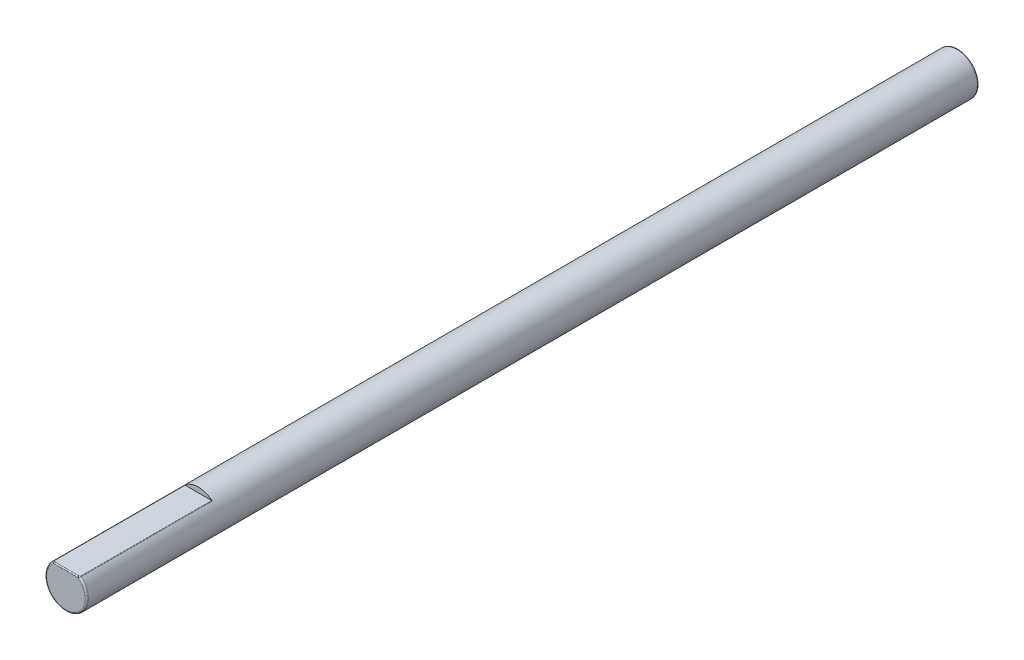
ISO-10303-21;
HEADER;
FILE_DESCRIPTION(('STEP AP214'),'2;1');
FILE_NAME('part.step','',(''),(''),'','','');
FILE_SCHEMA(('AUTOMOTIVE_DESIGN { 1 0 10303 214 1 1 1 1 }'));
ENDSEC;
DATA;
#1=APPLICATION_CONTEXT('core data for automotive mechanical design processes');
#2=APPLICATION_PROTOCOL_DEFINITION('international standard','automotive_design',2000,#1);
#3=PRODUCT_CONTEXT('',#1,'mechanical');
#4=PRODUCT('Part','Part','',(#3));
#5=PRODUCT_RELATED_PRODUCT_CATEGORY('part','',(#4));
#6=PRODUCT_DEFINITION_FORMATION('','',#4);
#7=PRODUCT_DEFINITION_CONTEXT('part definition',#1,'design');
#8=PRODUCT_DEFINITION('design','',#6,#7);
#9=PRODUCT_DEFINITION_SHAPE('','',#8);
#10=(LENGTH_UNIT() NAMED_UNIT(*) SI_UNIT(.MILLI.,.METRE.));
#11=(NAMED_UNIT(*) PLANE_ANGLE_UNIT() SI_UNIT($,.RADIAN.));
#12=(NAMED_UNIT(*) SI_UNIT($,.STERADIAN.) SOLID_ANGLE_UNIT());
#13=UNCERTAINTY_MEASURE_WITH_UNIT(LENGTH_MEASURE(1.E-05),#10,'distance_accuracy_value','');
#14=(GEOMETRIC_REPRESENTATION_CONTEXT(3) GLOBAL_UNCERTAINTY_ASSIGNED_CONTEXT((#13)) GLOBAL_UNIT_ASSIGNED_CONTEXT((#10,
#11,#12)) REPRESENTATION_CONTEXT('',''));
#15=CARTESIAN_POINT('',(0.,0.,0.));
#16=DIRECTION('',(0.,0.,1.));
#17=DIRECTION('',(1.,0.,0.));
#18=AXIS2_PLACEMENT_3D('',#15,#16,#17);
#19=CARTESIAN_POINT('',(0.,0.,67.564));
#20=DIRECTION('',(0.,0.,-1.));
#21=DIRECTION('',(-1.,0.,0.));
#22=AXIS2_PLACEMENT_3D('',#19,#20,#21);
#23=CYLINDRICAL_SURFACE('',#22,1.57734);
#24=CARTESIAN_POINT('',(0.,0.,0.127000000000002));
#25=DIRECTION('',(0.,0.,1.));
#26=DIRECTION('',(1.,0.,0.));
#27=AXIS2_PLACEMENT_3D('',#24,#25,#26);
#28=CIRCLE('',#27,1.57734);
#29=CARTESIAN_POINT('',(1.57734,0.,0.127000000000002));
#30=VERTEX_POINT('',#29);
#31=EDGE_CURVE('E211',#30,#30,#28,.T.);
#32=ORIENTED_EDGE('',*,*,#31,.T.);
#33=EDGE_LOOP('',(#32));
#34=FACE_BOUND('',#33,.T.);
#35=CARTESIAN_POINT('',(0.,0.,67.437));
#36=DIRECTION('',(0.,0.,1.));
#37=DIRECTION('',(1.,0.,0.));
#38=AXIS2_PLACEMENT_3D('',#35,#36,#37);
#39=CIRCLE('',#38,1.57734);
#40=CARTESIAN_POINT('',(1.05008224181955,1.17699989847716,67.437));
#41=VERTEX_POINT('',#40);
#42=CARTESIAN_POINT('',(-1.05008224182005,1.17699989847671,67.437));
#43=VERTEX_POINT('',#42);
#44=EDGE_CURVE('E112',#41,#43,#39,.F.);
#45=ORIENTED_EDGE('',*,*,#44,.T.);
#46=DIRECTION('',(0.,0.,-1.));
#47=VECTOR('',#46,1.);
#48=CARTESIAN_POINT('',(-1.05008224181955,1.17699989847716,67.564));
#49=LINE('',#48,#47);
#50=CARTESIAN_POINT('',(-1.05008224181955,1.17699989847716,57.531));
#51=VERTEX_POINT('',#50);
#52=EDGE_CURVE('E122',#43,#51,#49,.T.);
#53=ORIENTED_EDGE('',*,*,#52,.T.);
#54=CARTESIAN_POINT('',(0.,0.,57.531));
#55=DIRECTION('',(0.,0.,1.));
#56=DIRECTION('',(1.,0.,0.));
#57=AXIS2_PLACEMENT_3D('',#54,#55,#56);
#58=CIRCLE('',#57,1.57734);
#59=CARTESIAN_POINT('',(1.05008224181955,1.17699989847716,57.531));
#60=VERTEX_POINT('',#59);
#61=EDGE_CURVE('E100',#60,#51,#58,.T.);
#62=ORIENTED_EDGE('',*,*,#61,.F.);
#63=DIRECTION('',(0.,0.,-1.));
#64=VECTOR('',#63,1.);
#65=CARTESIAN_POINT('',(1.05008224181955,1.17699989847716,67.564));
#66=LINE('',#65,#64);
#67=EDGE_CURVE('E119',#60,#41,#66,.F.);
#68=ORIENTED_EDGE('',*,*,#67,.T.);
#69=EDGE_LOOP('',(#45,#53,#62,#68));
#70=FACE_BOUND('',#69,.T.);
#71=ADVANCED_FACE('F36',(#34,#70),#23,.T.);
#72=CARTESIAN_POINT('',(0.,0.,67.564));
#73=DIRECTION('',(0.,0.,1.));
#74=DIRECTION('',(1.,0.,0.));
#75=AXIS2_PLACEMENT_3D('',#72,#73,#74);
#76=PLANE('',#75);
#77=CARTESIAN_POINT('',(0.,0.,67.564));
#78=DIRECTION('',(0.,0.,1.));
#79=DIRECTION('',(1.,0.,0.));
#80=AXIS2_PLACEMENT_3D('',#77,#78,#79);
#81=CIRCLE('',#80,1.45034);
#82=CARTESIAN_POINT('',(-0.921288497703081,1.12014,67.564));
#83=VERTEX_POINT('',#82);
#84=CARTESIAN_POINT('',(0.921288497703081,1.12014,67.564));
#85=VERTEX_POINT('',#84);
#86=EDGE_CURVE('E206',#83,#85,#81,.T.);
#87=ORIENTED_EDGE('',*,*,#86,.T.);
#88=DIRECTION('',(1.,0.,0.));
#89=VECTOR('',#88,1.);
#90=CARTESIAN_POINT('',(0.,1.12014,67.564));
#91=LINE('',#90,#89);
#92=EDGE_CURVE('E63',#85,#83,#91,.F.);
#93=ORIENTED_EDGE('',*,*,#92,.T.);
#94=EDGE_LOOP('',(#87,#93));
#95=FACE_BOUND('',#94,.T.);
#96=ADVANCED_FACE('F225',(#95),#76,.T.);
#97=CARTESIAN_POINT('',(0.,0.,67.437));
#98=DIRECTION('',(0.,0.,1.));
#99=DIRECTION('',(1.,0.,0.));
#100=AXIS2_PLACEMENT_3D('',#97,#98,#99);
#101=TOROIDAL_SURFACE('',#100,1.45034,0.127);
#102=ORIENTED_EDGE('',*,*,#86,.F.);
#103=CARTESIAN_POINT('',(-0.87986517052399,1.19634,67.4806697328893));
#104=CARTESIAN_POINT('',(-0.839666437941503,1.19634,67.5901675130064));
#105=CARTESIAN_POINT('',(-0.855817177325138,1.08952494668937,67.5461743322232));
#106=CARTESIAN_POINT('',(-0.886463939819438,1.19634,67.4830622153946));
#107=CARTESIAN_POINT('',(-0.855734599828718,1.19634,67.5869285656864));
#108=CARTESIAN_POINT('',(-0.866077520928326,1.09442117774404,67.5521555380406));
#109=CARTESIAN_POINT('',(-0.893268629419193,1.19634,67.4848406859954));
#110=CARTESIAN_POINT('',(-0.870571194938305,1.19634,67.5830010582053));
#111=CARTESIAN_POINT('',(-0.876745748364134,1.09946153059766,67.5566017147645));
#112=CARTESIAN_POINT('',(-0.907144041533097,1.19634,67.4872156953218));
#113=CARTESIAN_POINT('',(-0.897308581726904,1.19634,67.5742225373876));
#114=CARTESIAN_POINT('',(-0.898673064185134,1.10971823287874,67.5625392385304));
#115=CARTESIAN_POINT('',(-0.914216556838026,1.19634,67.4878018711335));
#116=CARTESIAN_POINT('',(-0.909541477809107,1.19634,67.5693961021727));
#117=CARTESIAN_POINT('',(-0.909936467348809,1.11493572799375,67.5640046782875));
#118=CARTESIAN_POINT('',(-0.928007773539817,1.19634,67.4877982221766));
#119=CARTESIAN_POINT('',(-0.931729882803883,1.19634,67.5592036532382));
#120=CARTESIAN_POINT('',(-0.932074422629895,1.12508474427977,67.5639955550103));
#121=CARTESIAN_POINT('',(-0.934726530800715,1.19634,67.4872655847267));
#122=CARTESIAN_POINT('',(-0.941900280360275,1.19634,67.5539058025541));
#123=CARTESIAN_POINT('',(-0.942940355790191,1.13001755139257,67.5626639603392));
#124=CARTESIAN_POINT('',(-0.947949928776669,1.19634,67.4850469643477));
#125=CARTESIAN_POINT('',(-0.961002053202728,1.19634,67.5423097709004));
#126=CARTESIAN_POINT('',(-0.964475859021033,1.13970137814447,67.5571174094081));
#127=CARTESIAN_POINT('',(-0.954455307669196,1.19634,67.4833655256658));
#128=CARTESIAN_POINT('',(-0.970051164578806,1.19634,67.5360350474439));
#129=CARTESIAN_POINT('',(-0.975146033298497,1.14445303643834,67.5529138137577));
#130=CARTESIAN_POINT('',(-0.967680619915438,1.19634,67.4784054251793));
#131=CARTESIAN_POINT('',(-0.987839601379769,1.19634,67.5213178577252));
#132=CARTESIAN_POINT('',(-0.996976756655438,1.15408756250358,67.5405135633987));
#133=CARTESIAN_POINT('',(-0.974348807950885,1.19634,67.4749748777313));
#134=CARTESIAN_POINT('',(-0.996616052063423,1.19634,67.5127005981731));
#135=CARTESIAN_POINT('',(-1.00806727410583,1.15892990057361,67.5319371944349));
#136=CARTESIAN_POINT('',(-0.984862187982598,1.19634,67.4670807053982));
#137=CARTESIAN_POINT('',(-1.0101662139932,1.19634,67.4951149420122));
#138=CARTESIAN_POINT('',(-1.02564926830044,1.16654490914749,67.5122017634136));
#139=CARTESIAN_POINT('',(-0.989003658290052,1.19634,67.463038906611));
#140=CARTESIAN_POINT('',(-1.01543871618516,1.19634,67.4867363605221));
#141=CARTESIAN_POINT('',(-1.03261129671026,1.16953727267212,67.5020972665035));
#142=CARTESIAN_POINT('',(-0.994760773433793,1.19634,67.4547827897831));
#143=CARTESIAN_POINT('',(-1.02267410023603,1.19634,67.4704489448948));
#144=CARTESIAN_POINT('',(-1.04231409975494,1.17369163865705,67.4814569744761));
#145=CARTESIAN_POINT('',(-0.996743375883656,1.19634,67.4508399999536));
#146=CARTESIAN_POINT('',(-1.0251585729744,1.19634,67.462900537877));
#147=CARTESIAN_POINT('',(-1.04566583106471,1.17512006094954,67.4715999999009));
#148=CARTESIAN_POINT('',(-0.998872574060043,1.19634,67.4435291900877));
#149=CARTESIAN_POINT('',(-1.02780589371633,1.19634,67.4491535667342));
#150=CARTESIAN_POINT('',(-1.04926743163161,1.17665365075781,67.4533229752066));
#151=CARTESIAN_POINT('',(-0.999352999215082,1.19634,67.440261835307));
#152=CARTESIAN_POINT('',(-1.02840375915452,1.19634,67.4430637494845));
#153=CARTESIAN_POINT('',(-1.05008115678193,1.17699944738944,67.4451545882335));
#154=CARTESIAN_POINT('',(-0.999354053428679,1.19634,67.4348200261891));
#155=CARTESIAN_POINT('',(-1.02840517657672,1.19634,67.4329474411081));
#156=CARTESIAN_POINT('',(-1.05008296698962,1.17700019994274,67.4315500654955));
#157=CARTESIAN_POINT('',(-0.999140170580108,1.19634,67.4326425177128));
#158=CARTESIAN_POINT('',(-1.02813927476163,1.19634,67.4288948027106));
#159=CARTESIAN_POINT('',(-1.04972071712509,1.17684624886117,67.4261062943523));
#160=CARTESIAN_POINT('',(-0.998311894428676,1.19634,67.4283547269963));
#161=CARTESIAN_POINT('',(-1.02711193958815,1.19634,67.4208858538938));
#162=CARTESIAN_POINT('',(-1.04831906664627,1.17624980209277,67.4153868175988));
#163=CARTESIAN_POINT('',(-0.997695770873582,1.19634,67.4262447766828));
#164=CARTESIAN_POINT('',(-1.02634611648331,1.19634,67.4169215230605));
#165=CARTESIAN_POINT('',(-1.04727674067305,1.17580605985672,67.410111941805));
#166=CARTESIAN_POINT('',(-0.996893696151886,1.19634,67.4242096492899));
#167=CARTESIAN_POINT('',(-1.02534907888547,1.19634,67.4130743224521));
#168=CARTESIAN_POINT('',(-1.04592067981759,1.17522820619018,67.4050241232296));
#169=(BOUNDED_SURFACE() B_SPLINE_SURFACE(3,2,((#103,#104,#105),(#106,#107,#108),(#109,#110,
#111),(#112,#113,#114),(#115,#116,#117),(#118,#119,#120),(#121,#122,#123),(#124,#125,#126),
(#127,#128,#129),(#130,#131,#132),(#133,#134,#135),(#136,#137,#138),(#139,#140,#141),(#142,#143,
#144),(#145,#146,#147),(#148,#149,#150),(#151,#152,#153),(#154,#155,#156),(#157,#158,#159),
(#160,#161,#162),(#163,#164,#165),(#166,#167,#168)),.UNSPECIFIED.,.F.,.F.,
.F.) B_SPLINE_SURFACE_WITH_KNOTS((4,2,2,2,2,2,2,2,2,2,4),(3,3),(0.,0.0210049041153107,
0.0421916068899117,0.0623217667328647,0.0823727563898449,0.104572987576242,0.121643881976073,
0.134639503134324,0.144405530325835,0.150932433605052,0.157487599227386),(0.,1.),
.UNSPECIFIED.) GEOMETRIC_REPRESENTATION_ITEM() RATIONAL_B_SPLINE_SURFACE(((1.,0.546912994379381,
1.),(1.,0.576246040533938,1.),(1.,0.604159736509278,1.),(1.,0.657529870647927,1.),(1.,
0.682962950087153,1.),(1.,0.730046602659604,1.),(1.,0.751822554653164,1.),(1.,0.792954989594646,
1.),(1.,0.812320651279741,1.),(1.,0.85038125516778,1.),(1.,0.868781803166435,1.),(1.,
0.897019931958255,1.),(1.,0.907853689511749,1.),(1.,0.922730545184066,1.),(1.,0.927777333961913,
1.),(1.,0.933182770330257,1.),(1.,0.934394800989486,1.),(1.,0.934397302941354,1.),(1.,
0.933857607662283,1.),(1.,0.931759073909199,1.),(1.,0.930195832531433,1.),(1.,0.92815471192234,1.))) REPRESENTATION_ITEM('') SURFACE());
#170=CARTESIAN_POINT('',(-0.855817177325138,1.08952494668937,67.5461743322232));
#171=CARTESIAN_POINT('',(-0.866077520928326,1.09442117774404,67.5521555380406));
#172=CARTESIAN_POINT('',(-0.876745748364134,1.09946153059766,67.5566017147645));
#173=CARTESIAN_POINT('',(-0.898673064185134,1.10971823287874,67.5625392385304));
#174=CARTESIAN_POINT('',(-0.909936467348809,1.11493572799375,67.5640046782875));
#175=CARTESIAN_POINT('',(-0.932074422629895,1.12508474427977,67.5639955550103));
#176=CARTESIAN_POINT('',(-0.942940355790191,1.13001755139257,67.5626639603392));
#177=CARTESIAN_POINT('',(-0.964475859021033,1.13970137814447,67.5571174094081));
#178=CARTESIAN_POINT('',(-0.975146033298497,1.14445303643834,67.5529138137577));
#179=CARTESIAN_POINT('',(-0.996976756655437,1.15408756250358,67.5405135633987));
#180=CARTESIAN_POINT('',(-1.00806727410583,1.15892990057361,67.5319371944349));
#181=CARTESIAN_POINT('',(-1.02564926830044,1.16654490914749,67.5122017634136));
#182=CARTESIAN_POINT('',(-1.03261129671026,1.16953727267212,67.5020972665035));
#183=CARTESIAN_POINT('',(-1.04231409975494,1.17369163865705,67.4814569744761));
#184=CARTESIAN_POINT('',(-1.04566583106471,1.17512006094954,67.4715999999009));
#185=CARTESIAN_POINT('',(-1.04926743163161,1.17665365075781,67.4533229752066));
#186=CARTESIAN_POINT('',(-1.05008115678193,1.17699944738944,67.4451545882335));
#187=CARTESIAN_POINT('',(-1.05008296698962,1.17700019994274,67.4315500654955));
#188=CARTESIAN_POINT('',(-1.04972071712509,1.17684624886117,67.4261062943523));
#189=CARTESIAN_POINT('',(-1.04831906664627,1.17624980209277,67.4153868175988));
#190=CARTESIAN_POINT('',(-1.04727674067305,1.17580605985672,67.410111941805));
#191=CARTESIAN_POINT('',(-1.04592067981759,1.17522820619018,67.4050241232296));
#192=B_SPLINE_CURVE_WITH_KNOTS('',3,(#170,#171,#172,#173,#174,#175,#176,#177,#178,#179,#180,
#181,#182,#183,#184,#185,#186,#187,#188,#189,#190,#191),.UNSPECIFIED.,.F.,.F.,(4,2,2,2,2,2,2,2,
2,2,4),(0.,0.0210049041153107,0.0421916068899117,0.0623217667328647,0.0823727563898449,
0.104572987576242,0.121643881976073,0.134639503134324,0.144405530325835,0.150932433605052,
0.157487599227386),.UNSPECIFIED.);
#193=EDGE_CURVE('E139',#83,#43,#192,.T.);
#194=ORIENTED_EDGE('',*,*,#193,.T.);
#195=ORIENTED_EDGE('',*,*,#44,.F.);
#196=CARTESIAN_POINT('',(0.996893696150638,1.19634,67.4242096492867));
#197=CARTESIAN_POINT('',(1.02534907888392,1.19634,67.413074322446));
#198=CARTESIAN_POINT('',(1.04592067981548,1.17522820618928,67.4050241232216));
#199=CARTESIAN_POINT('',(0.997693459868979,1.19634,67.4262456754124));
#200=CARTESIAN_POINT('',(1.02634298468636,1.19634,67.4169230148123));
#201=CARTESIAN_POINT('',(1.04727277381541,1.1758044069408,67.4101141887601));
#202=CARTESIAN_POINT('',(0.998310562328588,1.19634,67.4283544865847));
#203=CARTESIAN_POINT('',(1.02711015906912,1.19634,67.420885317168));
#204=CARTESIAN_POINT('',(1.04831678396097,1.17624884796893,67.4153862167199));
#205=CARTESIAN_POINT('',(0.999141140633466,1.19634,67.4326409122798));
#206=CARTESIAN_POINT('',(1.02814059866535,1.19634,67.4288918708969));
#207=CARTESIAN_POINT('',(1.04972238564775,1.17684694084344,67.4261022808734));
#208=CARTESIAN_POINT('',(0.999356174847839,1.19634,67.4348182277596));
#209=CARTESIAN_POINT('',(1.02840804677395,1.19634,67.4329441887454));
#210=CARTESIAN_POINT('',(1.05008661194096,1.17700171540507,67.4315455694602));
#211=CARTESIAN_POINT('',(0.999348556027344,1.19634,67.4413528985692));
#212=CARTESIAN_POINT('',(1.02839774935248,1.19634,67.4450919872012));
#213=CARTESIAN_POINT('',(1.05007352290063,1.176996273487,67.4478822463012));
#214=CARTESIAN_POINT('',(0.998477410604523,1.19634,67.4457235372999));
#215=CARTESIAN_POINT('',(1.0273106459164,1.19634,67.4532547962304));
#216=CARTESIAN_POINT('',(1.04859760378083,1.17636933514978,67.4588088432124));
#217=CARTESIAN_POINT('',(0.995318495118498,1.19634,67.4538353025482));
#218=CARTESIAN_POINT('',(1.02338106547821,1.19634,67.4686217679901));
#219=CARTESIAN_POINT('',(1.0432581459333,1.17409321148618,67.4790882563981));
#220=CARTESIAN_POINT('',(0.993038365441964,1.19634,67.4575796867753));
#221=CARTESIAN_POINT('',(1.02051709178677,1.19634,67.4758841919937));
#222=CARTESIAN_POINT('',(1.03940748475289,1.17244953947149,67.488449216947));
#223=CARTESIAN_POINT('',(0.986355866778853,1.19634,67.4658590327874));
#224=CARTESIAN_POINT('',(1.01207728618304,1.19634,67.4925269221543));
#225=CARTESIAN_POINT('',(1.02815903916294,1.16762443418578,67.5091475819556));
#226=CARTESIAN_POINT('',(0.98145990113402,1.19634,67.4699773023808));
#227=CARTESIAN_POINT('',(1.00580558693023,1.19634,67.5013341876952));
#228=CARTESIAN_POINT('',(1.01994447754918,1.16408358146227,67.5194432559472));
#229=CARTESIAN_POINT('',(0.968263559261528,1.19634,67.4784400012589));
#230=CARTESIAN_POINT('',(0.988576459614419,1.19634,67.5212265811864));
#231=CARTESIAN_POINT('',(0.997936247605258,1.1545131048354,67.540600003153));
#232=CARTESIAN_POINT('',(0.959459960177419,1.19634,67.4819359476676));
#233=CARTESIAN_POINT('',(0.976760217081495,1.19634,67.5311220862782));
#234=CARTESIAN_POINT('',(0.983362339188115,1.14810669595002,67.5493398691721));
#235=CARTESIAN_POINT('',(0.940881620447271,1.19634,67.4866750597365));
#236=CARTESIAN_POINT('',(0.950794587306845,1.19634,67.5491661845361));
#237=CARTESIAN_POINT('',(0.952912059810947,1.13453402071416,67.5611876493381));
#238=CARTESIAN_POINT('',(0.931080413766853,1.19634,67.4877990196295));
#239=CARTESIAN_POINT('',(0.936290387324466,1.19634,67.5571125030473));
#240=CARTESIAN_POINT('',(0.937006881160724,1.12734588165478,67.5639975490669));
#241=CARTESIAN_POINT('',(0.914246763593576,1.19634,67.4878007050252));
#242=CARTESIAN_POINT('',(0.909592336731492,1.19634,67.5693698084138));
#243=CARTESIAN_POINT('',(0.909984818605025,1.11495798022909,67.5640017625579));
#244=CARTESIAN_POINT('',(0.907209834207561,1.19634,67.4872206513581));
#245=CARTESIAN_POINT('',(0.897425871058924,1.19634,67.5741746383883));
#246=CARTESIAN_POINT('',(0.898777742275719,1.10976678471946,67.5625516283933));
#247=CARTESIAN_POINT('',(0.893336091037547,1.19634,67.4848582635467));
#248=CARTESIAN_POINT('',(0.870711766506312,1.19634,67.5829639384218));
#249=CARTESIAN_POINT('',(0.876851633922378,1.09951148207295,67.5566456588688));
#250=CARTESIAN_POINT('',(0.886499472055093,1.19634,67.4830747970968));
#251=CARTESIAN_POINT('',(0.855817751976035,1.19634,67.586912186489));
#252=CARTESIAN_POINT('',(0.86613307169616,1.0944474992908,67.5521869927452));
#253=CARTESIAN_POINT('',(0.879865170524432,1.19634,67.4806697328894));
#254=CARTESIAN_POINT('',(0.839666437942626,1.19634,67.5901675130062));
#255=CARTESIAN_POINT('',(0.855817177325819,1.08952494668969,67.5461743322236));
#256=(BOUNDED_SURFACE() B_SPLINE_SURFACE(3,2,((#196,#197,#198),(#199,#200,#201),(#202,#203,
#204),(#205,#206,#207),(#208,#209,#210),(#211,#212,#213),(#214,#215,#216),(#217,#218,#219),
(#220,#221,#222),(#223,#224,#225),(#226,#227,#228),(#229,#230,#231),(#232,#233,#234),(#235,#236,
#237),(#238,#239,#240),(#241,#242,#243),(#244,#245,#246),(#247,#248,#249),(#250,#251,#252),
(#253,#254,#255)),.UNSPECIFIED.,.F.,.F.,.F.) B_SPLINE_SURFACE_WITH_KNOTS((4,2,2,2,2,2,2,2,2,4),
(3,3),(0.,0.00655376163974078,0.0130820685907793,0.0261068277571614,0.0390615709761231,
0.0579167770109421,0.0858638126093137,0.115184836333704,0.136270684248077,0.157376399807142),
(0.,1.),.UNSPECIFIED.) GEOMETRIC_REPRESENTATION_ITEM() RATIONAL_B_SPLINE_SURFACE(((1.,
0.928154711919159,1.),(1.,0.930190380602178,1.),(1.,0.931755899269483,1.),(1.,0.93385986323189,
1.),(1.,0.934402274044589,1.),(1.,0.934384383059323,1.),(1.,0.932189618950601,1.),(1.,
0.924141494950078,1.),(1.,0.918307865642746,1.),(1.,0.900934238544066,1.),(1.,0.888005365570514,
1.),(1.,0.852059774208675,1.),(1.,0.827184858411696,1.),(1.,0.771538943160833,1.),(1.,
0.740538193773175,1.),(1.,0.683064998474458,1.),(1.,0.657766177008975,1.),(1.,0.604435505018622,
1.),(1.,0.576401101821406,1.),(1.,0.546912994381296,1.))) REPRESENTATION_ITEM('') SURFACE());
#257=CARTESIAN_POINT('',(1.04592067981548,1.17522820618928,67.4050241232216));
#258=CARTESIAN_POINT('',(1.04727277381541,1.1758044069408,67.4101141887601));
#259=CARTESIAN_POINT('',(1.04831678396097,1.17624884796893,67.4153862167199));
#260=CARTESIAN_POINT('',(1.04972238564775,1.17684694084344,67.4261022808734));
#261=CARTESIAN_POINT('',(1.05008661194096,1.17700171540507,67.4315455694602));
#262=CARTESIAN_POINT('',(1.05007352290063,1.176996273487,67.4478822463012));
#263=CARTESIAN_POINT('',(1.04859760378083,1.17636933514978,67.4588088432124));
#264=CARTESIAN_POINT('',(1.0432581459333,1.17409321148618,67.4790882563981));
#265=CARTESIAN_POINT('',(1.03940748475289,1.17244953947149,67.488449216947));
#266=CARTESIAN_POINT('',(1.02815903916294,1.16762443418578,67.5091475819556));
#267=CARTESIAN_POINT('',(1.01994447754918,1.16408358146227,67.5194432559472));
#268=CARTESIAN_POINT('',(0.997936247605258,1.1545131048354,67.540600003153));
#269=CARTESIAN_POINT('',(0.983362339188116,1.14810669595002,67.5493398691721));
#270=CARTESIAN_POINT('',(0.952912059810947,1.13453402071416,67.5611876493381));
#271=CARTESIAN_POINT('',(0.937006881160724,1.12734588165478,67.5639975490669));
#272=CARTESIAN_POINT('',(0.909984818605026,1.11495798022909,67.5640017625579));
#273=CARTESIAN_POINT('',(0.898777742275719,1.10976678471946,67.5625516283933));
#274=CARTESIAN_POINT('',(0.876851633922378,1.09951148207295,67.5566456588688));
#275=CARTESIAN_POINT('',(0.86613307169616,1.0944474992908,67.5521869927452));
#276=CARTESIAN_POINT('',(0.855817177325819,1.08952494668969,67.5461743322236));
#277=B_SPLINE_CURVE_WITH_KNOTS('',3,(#257,#258,#259,#260,#261,#262,#263,#264,#265,#266,#267,
#268,#269,#270,#271,#272,#273,#274,#275,#276),.UNSPECIFIED.,.F.,.F.,(4,2,2,2,2,2,2,2,2,4),(0.,
0.00655376163974078,0.0130820685907793,0.0261068277571614,0.0390615709761231,0.0579167770109421,
0.0858638126093137,0.115184836333704,0.136270684248077,0.157376399807142),.UNSPECIFIED.);
#278=EDGE_CURVE('E57',#41,#85,#277,.T.);
#279=ORIENTED_EDGE('',*,*,#278,.T.);
#280=EDGE_LOOP('',(#102,#194,#195,#279));
#281=FACE_BOUND('',#280,.T.);
#282=ADVANCED_FACE('F145',(#281),#101,.T.);
#283=CARTESIAN_POINT('',(0.,0.,0.));
#284=DIRECTION('',(0.,0.,1.));
#285=DIRECTION('',(1.,0.,0.));
#286=AXIS2_PLACEMENT_3D('',#283,#284,#285);
#287=PLANE('',#286);
#288=CARTESIAN_POINT('',(0.,0.,0.));
#289=DIRECTION('',(0.,0.,1.));
#290=DIRECTION('',(1.,0.,0.));
#291=AXIS2_PLACEMENT_3D('',#288,#289,#290);
#292=CIRCLE('',#291,1.45034);
#293=CARTESIAN_POINT('',(1.45034,0.,0.));
#294=VERTEX_POINT('',#293);
#295=EDGE_CURVE('E208',#294,#294,#292,.F.);
#296=ORIENTED_EDGE('',*,*,#295,.T.);
#297=EDGE_LOOP('',(#296));
#298=FACE_BOUND('',#297,.T.);
#299=ADVANCED_FACE('F232',(#298),#287,.F.);
#300=CARTESIAN_POINT('',(0.,0.,0.127000000000002));
#301=DIRECTION('',(0.,0.,1.));
#302=DIRECTION('',(1.,0.,0.));
#303=AXIS2_PLACEMENT_3D('',#300,#301,#302);
#304=TOROIDAL_SURFACE('',#303,1.45034,0.127);
#305=ORIENTED_EDGE('',*,*,#295,.F.);
#306=EDGE_LOOP('',(#305));
#307=FACE_BOUND('',#306,.T.);
#308=ORIENTED_EDGE('',*,*,#31,.F.);
#309=EDGE_LOOP('',(#308));
#310=FACE_BOUND('',#309,.T.);
#311=ADVANCED_FACE('F233',(#307,#310),#304,.T.);
#312=CARTESIAN_POINT('',(-1.57734,1.57733999999999,57.531));
#313=DIRECTION('',(0.,0.,1.));
#314=DIRECTION('',(1.,0.,0.));
#315=AXIS2_PLACEMENT_3D('',#312,#313,#314);
#316=PLANE('',#315);
#317=ORIENTED_EDGE('',*,*,#61,.T.);
#318=CARTESIAN_POINT('',(-0.999353631103625,1.12014,57.531));
#319=DIRECTION('',(0.,0.,1.));
#320=DIRECTION('',(1.,0.,0.));
#321=AXIS2_PLACEMENT_3D('',#318,#319,#320);
#322=CIRCLE('',#321,0.0762);
#323=CARTESIAN_POINT('',(-0.999353631103625,1.19633999999999,57.531));
#324=VERTEX_POINT('',#323);
#325=EDGE_CURVE('E49',#51,#324,#322,.F.);
#326=ORIENTED_EDGE('',*,*,#325,.T.);
#327=DIRECTION('',(1.,0.,0.));
#328=VECTOR('',#327,1.);
#329=CARTESIAN_POINT('',(-1.57734,1.19633999999999,57.531));
#330=LINE('',#329,#328);
#331=CARTESIAN_POINT('',(0.999353631103625,1.19633999999999,57.531));
#332=VERTEX_POINT('',#331);
#333=EDGE_CURVE('E98',#324,#332,#330,.T.);
#334=ORIENTED_EDGE('',*,*,#333,.T.);
#335=CARTESIAN_POINT('',(0.999353631103625,1.12014,57.531));
#336=DIRECTION('',(0.,0.,1.));
#337=DIRECTION('',(1.,0.,0.));
#338=AXIS2_PLACEMENT_3D('',#335,#336,#337);
#339=CIRCLE('',#338,0.0762);
#340=EDGE_CURVE('E11',#332,#60,#339,.F.);
#341=ORIENTED_EDGE('',*,*,#340,.T.);
#342=EDGE_LOOP('',(#317,#326,#334,#341));
#343=FACE_BOUND('',#342,.T.);
#344=ADVANCED_FACE('F97',(#343),#316,.T.);
#345=CARTESIAN_POINT('',(-1.57734,1.19633999999999,57.531));
#346=DIRECTION('',(0.,1.,0.));
#347=DIRECTION('',(0.,0.,1.));
#348=AXIS2_PLACEMENT_3D('',#345,#346,#347);
#349=PLANE('',#348);
#350=ORIENTED_EDGE('',*,*,#333,.F.);
#351=DIRECTION('',(0.,0.,1.));
#352=VECTOR('',#351,1.);
#353=CARTESIAN_POINT('',(-0.999353631103625,1.19634,67.4369999999996));
#354=LINE('',#353,#352);
#355=CARTESIAN_POINT('',(-0.999353631103625,1.19634,67.437));
#356=VERTEX_POINT('',#355);
#357=EDGE_CURVE('E109',#324,#356,#354,.T.);
#358=ORIENTED_EDGE('',*,*,#357,.T.);
#359=CARTESIAN_POINT('',(-0.996893696151886,1.19634,67.4242096492899));
#360=CARTESIAN_POINT('',(-0.997695770873582,1.19634,67.4262447766828));
#361=CARTESIAN_POINT('',(-0.998311894428677,1.19634,67.4283547269963));
#362=CARTESIAN_POINT('',(-0.999140170580109,1.19634,67.4326425177128));
#363=CARTESIAN_POINT('',(-0.999354053428679,1.19634,67.4348200261891));
#364=CARTESIAN_POINT('',(-0.999352999215082,1.19634,67.440261835307));
#365=CARTESIAN_POINT('',(-0.998872574060043,1.19634,67.4435291900877));
#366=CARTESIAN_POINT('',(-0.996743375883656,1.19634,67.4508399999536));
#367=CARTESIAN_POINT('',(-0.994760773433793,1.19634,67.4547827897831));
#368=CARTESIAN_POINT('',(-0.989003658290052,1.19634,67.463038906611));
#369=CARTESIAN_POINT('',(-0.984862187982598,1.19634,67.4670807053982));
#370=CARTESIAN_POINT('',(-0.974348807950885,1.19634,67.4749748777313));
#371=CARTESIAN_POINT('',(-0.967680619915438,1.19634,67.4784054251793));
#372=CARTESIAN_POINT('',(-0.954455307669196,1.19634,67.4833655256658));
#373=CARTESIAN_POINT('',(-0.947949928776669,1.19634,67.4850469643477));
#374=CARTESIAN_POINT('',(-0.934726530800715,1.19634,67.4872655847267));
#375=CARTESIAN_POINT('',(-0.928007773539817,1.19634,67.4877982221766));
#376=CARTESIAN_POINT('',(-0.914216556838026,1.19634,67.4878018711335));
#377=CARTESIAN_POINT('',(-0.907144041533097,1.19634,67.4872156953218));
#378=CARTESIAN_POINT('',(-0.893268629419193,1.19634,67.4848406859954));
#379=CARTESIAN_POINT('',(-0.886463939819438,1.19634,67.4830622153946));
#380=CARTESIAN_POINT('',(-0.87986517052399,1.19634,67.4806697328893));
#381=B_SPLINE_CURVE_WITH_KNOTS('',3,(#359,#360,#361,#362,#363,#364,#365,#366,#367,#368,#369,
#370,#371,#372,#373,#374,#375,#376,#377,#378,#379,#380),.UNSPECIFIED.,.F.,.F.,(4,2,2,2,2,2,2,2,
2,2,4),(0.,0.00655516562233412,0.0130820689015507,0.0228480960930624,0.0358437172513129,
0.0529146116511436,0.075114842837541,0.0951658324945212,0.115295992337474,0.136482695112075,
0.157487599227386),.UNSPECIFIED.);
#382=CARTESIAN_POINT('',(-0.921288497703081,1.19634,67.4878));
#383=VERTEX_POINT('',#382);
#384=EDGE_CURVE('E120',#356,#383,#381,.T.);
#385=ORIENTED_EDGE('',*,*,#384,.T.);
#386=DIRECTION('',(1.,0.,0.));
#387=VECTOR('',#386,1.);
#388=CARTESIAN_POINT('',(-1.57734,1.19634,67.4878));
#389=LINE('',#388,#387);
#390=CARTESIAN_POINT('',(0.921288497703052,1.19634,67.4878));
#391=VERTEX_POINT('',#390);
#392=EDGE_CURVE('E198',#383,#391,#389,.T.);
#393=ORIENTED_EDGE('',*,*,#392,.T.);
#394=CARTESIAN_POINT('',(0.879865170524432,1.19634,67.4806697328894));
#395=CARTESIAN_POINT('',(0.886499472055093,1.19634,67.4830747970968));
#396=CARTESIAN_POINT('',(0.893336091037547,1.19634,67.4848582635467));
#397=CARTESIAN_POINT('',(0.907209834207561,1.19634,67.4872206513581));
#398=CARTESIAN_POINT('',(0.914246763593576,1.19634,67.4878007050252));
#399=CARTESIAN_POINT('',(0.931080413766853,1.19634,67.4877990196295));
#400=CARTESIAN_POINT('',(0.940881620447271,1.19634,67.4866750597365));
#401=CARTESIAN_POINT('',(0.959459960177418,1.19634,67.4819359476676));
#402=CARTESIAN_POINT('',(0.968263559261528,1.19634,67.4784400012589));
#403=CARTESIAN_POINT('',(0.98145990113402,1.19634,67.4699773023808));
#404=CARTESIAN_POINT('',(0.986355866778853,1.19634,67.4658590327874));
#405=CARTESIAN_POINT('',(0.993038365441963,1.19634,67.4575796867753));
#406=CARTESIAN_POINT('',(0.995318495118498,1.19634,67.4538353025482));
#407=CARTESIAN_POINT('',(0.998477410604523,1.19634,67.4457235372999));
#408=CARTESIAN_POINT('',(0.999348556027344,1.19634,67.4413528985692));
#409=CARTESIAN_POINT('',(0.999356174847839,1.19634,67.4348182277596));
#410=CARTESIAN_POINT('',(0.999141140633466,1.19634,67.4326409122798));
#411=CARTESIAN_POINT('',(0.998310562328588,1.19634,67.4283544865847));
#412=CARTESIAN_POINT('',(0.997693459868979,1.19634,67.4262456754124));
#413=CARTESIAN_POINT('',(0.996893696150638,1.19634,67.4242096492867));
#414=B_SPLINE_CURVE_WITH_KNOTS('',3,(#394,#395,#396,#397,#398,#399,#400,#401,#402,#403,#404,
#405,#406,#407,#408,#409,#410,#411,#412,#413),.UNSPECIFIED.,.F.,.F.,(4,2,2,2,2,2,2,2,2,4),(0.,
0.0211057155590645,0.0421915634734381,0.0715125871978283,0.0994596227961999,0.118314828831019,
0.131269572049981,0.144294331216363,0.150822638167401,0.157376399807142),.UNSPECIFIED.);
#415=CARTESIAN_POINT('',(0.999353631103625,1.19634,67.437));
#416=VERTEX_POINT('',#415);
#417=EDGE_CURVE('E195',#391,#416,#414,.T.);
#418=ORIENTED_EDGE('',*,*,#417,.T.);
#419=DIRECTION('',(0.,0.,1.));
#420=VECTOR('',#419,1.);
#421=CARTESIAN_POINT('',(0.999353631103625,1.19633999999999,57.531));
#422=LINE('',#421,#420);
#423=EDGE_CURVE('E111',#416,#332,#422,.F.);
#424=ORIENTED_EDGE('',*,*,#423,.T.);
#425=EDGE_LOOP('',(#350,#358,#385,#393,#418,#424));
#426=FACE_BOUND('',#425,.T.);
#427=ADVANCED_FACE('F108',(#426),#349,.T.);
#428=CARTESIAN_POINT('',(0.999353631103625,1.12014,67.564));
#429=DIRECTION('',(0.,0.,-1.));
#430=DIRECTION('',(-1.,0.,0.));
#431=AXIS2_PLACEMENT_3D('',#428,#429,#430);
#432=CYLINDRICAL_SURFACE('',#431,0.0762);
#433=ORIENTED_EDGE('',*,*,#340,.F.);
#434=ORIENTED_EDGE('',*,*,#423,.F.);
#435=CARTESIAN_POINT('',(0.999353631103625,1.12014,67.437));
#436=DIRECTION('',(0.,0.,1.));
#437=DIRECTION('',(1.,0.,0.));
#438=AXIS2_PLACEMENT_3D('',#435,#436,#437);
#439=CIRCLE('',#438,0.0762);
#440=EDGE_CURVE('E113',#41,#416,#439,.T.);
#441=ORIENTED_EDGE('',*,*,#440,.F.);
#442=ORIENTED_EDGE('',*,*,#67,.F.);
#443=EDGE_LOOP('',(#433,#434,#441,#442));
#444=FACE_BOUND('',#443,.T.);
#445=ADVANCED_FACE('F38',(#444),#432,.T.);
#446=ORIENTED_EDGE('',*,*,#440,.T.);
#447=ORIENTED_EDGE('',*,*,#417,.F.);
#448=CARTESIAN_POINT('',(0.921288497703052,1.12014,67.4878));
#449=DIRECTION('',(-1.,0.,-2.36191024452227E-13));
#450=DIRECTION('',(-2.36191024452227E-13,0.,1.));
#451=AXIS2_PLACEMENT_3D('',#448,#449,#450);
#452=CIRCLE('',#451,0.0762);
#453=EDGE_CURVE('E188',#85,#391,#452,.T.);
#454=ORIENTED_EDGE('',*,*,#453,.F.);
#455=ORIENTED_EDGE('',*,*,#278,.F.);
#456=EDGE_LOOP('',(#446,#447,#454,#455));
#457=FACE_BOUND('',#456,.T.);
#458=ADVANCED_FACE('F155',(#457),#256,.T.);
#459=CARTESIAN_POINT('',(-1.57734,1.12014,67.4878));
#460=DIRECTION('',(1.,0.,0.));
#461=DIRECTION('',(0.,0.,-1.));
#462=AXIS2_PLACEMENT_3D('',#459,#460,#461);
#463=CYLINDRICAL_SURFACE('',#462,0.0762);
#464=ORIENTED_EDGE('',*,*,#453,.T.);
#465=ORIENTED_EDGE('',*,*,#392,.F.);
#466=CARTESIAN_POINT('',(-0.921288497703081,1.12014,67.4878));
#467=DIRECTION('',(-1.,0.,0.));
#468=DIRECTION('',(0.,0.,1.));
#469=AXIS2_PLACEMENT_3D('',#466,#467,#468);
#470=CIRCLE('',#469,0.0762);
#471=EDGE_CURVE('E186',#83,#383,#470,.T.);
#472=ORIENTED_EDGE('',*,*,#471,.F.);
#473=ORIENTED_EDGE('',*,*,#92,.F.);
#474=EDGE_LOOP('',(#464,#465,#472,#473));
#475=FACE_BOUND('',#474,.T.);
#476=ADVANCED_FACE('F159',(#475),#463,.T.);
#477=ORIENTED_EDGE('',*,*,#471,.T.);
#478=ORIENTED_EDGE('',*,*,#384,.F.);
#479=CARTESIAN_POINT('',(-0.999353631103625,1.12014,67.437));
#480=DIRECTION('',(0.,0.,-1.));
#481=DIRECTION('',(-1.,0.,0.));
#482=AXIS2_PLACEMENT_3D('',#479,#480,#481);
#483=CIRCLE('',#482,0.0762);
#484=EDGE_CURVE('E117',#43,#356,#483,.T.);
#485=ORIENTED_EDGE('',*,*,#484,.F.);
#486=ORIENTED_EDGE('',*,*,#193,.F.);
#487=EDGE_LOOP('',(#477,#478,#485,#486));
#488=FACE_BOUND('',#487,.T.);
#489=ADVANCED_FACE('F172',(#488),#169,.T.);
#490=CARTESIAN_POINT('',(-0.999353631103625,1.12014,67.564));
#491=DIRECTION('',(0.,0.,-1.));
#492=DIRECTION('',(-1.,0.,0.));
#493=AXIS2_PLACEMENT_3D('',#490,#491,#492);
#494=CYLINDRICAL_SURFACE('',#493,0.0762);
#495=ORIENTED_EDGE('',*,*,#325,.F.);
#496=ORIENTED_EDGE('',*,*,#52,.F.);
#497=ORIENTED_EDGE('',*,*,#484,.T.);
#498=ORIENTED_EDGE('',*,*,#357,.F.);
#499=EDGE_LOOP('',(#495,#496,#497,#498));
#500=FACE_BOUND('',#499,.T.);
#501=ADVANCED_FACE('F115',(#500),#494,.T.);
#502=CLOSED_SHELL('',(#71,#96,#282,#299,#311,#344,#427,#445,#458,#476,#489,#501));
#503=MANIFOLD_SOLID_BREP('B2',#502);
#504=ADVANCED_BREP_SHAPE_REPRESENTATION('',(#18,#503),#14);
#505=SHAPE_DEFINITION_REPRESENTATION(#9,#504);
ENDSEC;
END-ISO-10303-21;
